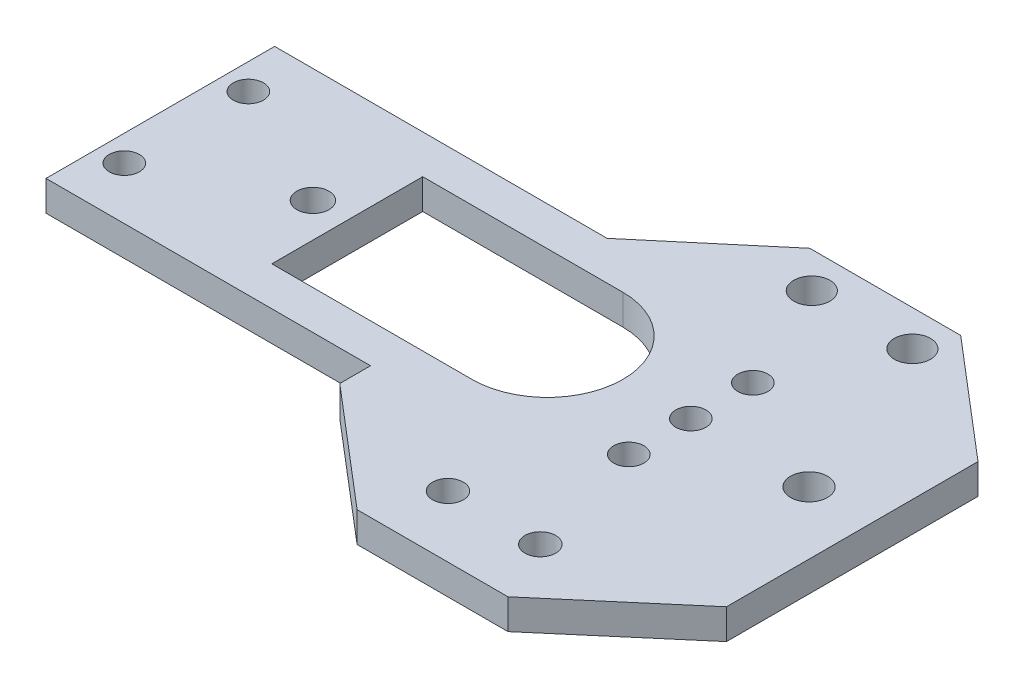
ISO-10303-21;
HEADER;
FILE_DESCRIPTION(('STEP AP214'),'2;1');
FILE_NAME('part.step','',(''),(''),'','','');
FILE_SCHEMA(('AUTOMOTIVE_DESIGN { 1 0 10303 214 1 1 1 1 }'));
ENDSEC;
DATA;
#1=APPLICATION_CONTEXT('core data for automotive mechanical design processes');
#2=APPLICATION_PROTOCOL_DEFINITION('international standard','automotive_design',2000,#1);
#3=PRODUCT_CONTEXT('',#1,'mechanical');
#4=PRODUCT('Part','Part','',(#3));
#5=PRODUCT_RELATED_PRODUCT_CATEGORY('part','',(#4));
#6=PRODUCT_DEFINITION_FORMATION('','',#4);
#7=PRODUCT_DEFINITION_CONTEXT('part definition',#1,'design');
#8=PRODUCT_DEFINITION('design','',#6,#7);
#9=PRODUCT_DEFINITION_SHAPE('','',#8);
#10=(LENGTH_UNIT() NAMED_UNIT(*) SI_UNIT(.MILLI.,.METRE.));
#11=(NAMED_UNIT(*) PLANE_ANGLE_UNIT() SI_UNIT($,.RADIAN.));
#12=(NAMED_UNIT(*) SI_UNIT($,.STERADIAN.) SOLID_ANGLE_UNIT());
#13=UNCERTAINTY_MEASURE_WITH_UNIT(LENGTH_MEASURE(1.E-05),#10,'distance_accuracy_value','');
#14=(GEOMETRIC_REPRESENTATION_CONTEXT(3) GLOBAL_UNCERTAINTY_ASSIGNED_CONTEXT((#13)) GLOBAL_UNIT_ASSIGNED_CONTEXT((#10,
#11,#12)) REPRESENTATION_CONTEXT('',''));
#15=CARTESIAN_POINT('',(0.,0.,0.));
#16=DIRECTION('',(0.,0.,1.));
#17=DIRECTION('',(1.,0.,0.));
#18=AXIS2_PLACEMENT_3D('',#15,#16,#17);
#19=CARTESIAN_POINT('',(0.,3.,0.));
#20=DIRECTION('',(0.,1.,0.));
#21=DIRECTION('',(0.,0.,1.));
#22=AXIS2_PLACEMENT_3D('',#19,#20,#21);
#23=PLANE('',#22);
#24=CARTESIAN_POINT('',(-1.03922495505572,3.,-20.8623911356369));
#25=DIRECTION('',(0.,1.,0.));
#26=DIRECTION('',(0.,0.,1.));
#27=AXIS2_PLACEMENT_3D('',#24,#25,#26);
#28=CIRCLE('',#27,1.8);
#29=CARTESIAN_POINT('',(-1.03922495505572,3.,-19.0623911356369));
#30=VERTEX_POINT('',#29);
#31=EDGE_CURVE('E268',#30,#30,#28,.T.);
#32=ORIENTED_EDGE('',*,*,#31,.F.);
#33=EDGE_LOOP('',(#32));
#34=FACE_BOUND('',#33,.T.);
#35=CARTESIAN_POINT('',(-11.0392249550557,3.,-20.8623911356369));
#36=DIRECTION('',(0.,1.,0.));
#37=DIRECTION('',(0.,0.,1.));
#38=AXIS2_PLACEMENT_3D('',#35,#36,#37);
#39=CIRCLE('',#38,1.8);
#40=CARTESIAN_POINT('',(-11.0392249550557,3.,-19.0623911356369));
#41=VERTEX_POINT('',#40);
#42=EDGE_CURVE('E257',#41,#41,#39,.T.);
#43=ORIENTED_EDGE('',*,*,#42,.F.);
#44=EDGE_LOOP('',(#43));
#45=FACE_BOUND('',#44,.T.);
#46=CARTESIAN_POINT('',(-56.1948883954649,3.,-10.0085840249346));
#47=DIRECTION('',(0.,1.,0.));
#48=DIRECTION('',(0.,0.,1.));
#49=AXIS2_PLACEMENT_3D('',#46,#47,#48);
#50=CIRCLE('',#49,1.5);
#51=CARTESIAN_POINT('',(-56.1948883954649,3.,-8.50858402493456));
#52=VERTEX_POINT('',#51);
#53=EDGE_CURVE('E274',#52,#52,#50,.T.);
#54=ORIENTED_EDGE('',*,*,#53,.F.);
#55=EDGE_LOOP('',(#54));
#56=FACE_BOUND('',#55,.T.);
#57=CARTESIAN_POINT('',(-6.04488839546491,3.,-10.0085840249346));
#58=DIRECTION('',(0.,1.,0.));
#59=DIRECTION('',(0.,0.,1.));
#60=AXIS2_PLACEMENT_3D('',#57,#58,#59);
#61=CIRCLE('',#60,1.5);
#62=CARTESIAN_POINT('',(-6.04488839546491,3.,-8.50858402493456));
#63=VERTEX_POINT('',#62);
#64=EDGE_CURVE('E286',#63,#63,#61,.T.);
#65=ORIENTED_EDGE('',*,*,#64,.F.);
#66=EDGE_LOOP('',(#65));
#67=FACE_BOUND('',#66,.T.);
#68=CARTESIAN_POINT('',(-43.6105441866026,3.,-3.8423623744822));
#69=DIRECTION('',(0.,1.,0.));
#70=DIRECTION('',(0.,0.,1.));
#71=AXIS2_PLACEMENT_3D('',#68,#69,#70);
#72=CIRCLE('',#71,1.59727524343108);
#73=CARTESIAN_POINT('',(-43.6105441866026,3.,-2.24508713105113));
#74=VERTEX_POINT('',#73);
#75=EDGE_CURVE('E298',#74,#74,#72,.T.);
#76=ORIENTED_EDGE('',*,*,#75,.F.);
#77=EDGE_LOOP('',(#76));
#78=FACE_BOUND('',#77,.T.);
#79=CARTESIAN_POINT('',(-2.70488839546491,3.,14.4576376255178));
#80=DIRECTION('',(0.,1.,0.));
#81=DIRECTION('',(0.,0.,1.));
#82=AXIS2_PLACEMENT_3D('',#79,#80,#81);
#83=CIRCLE('',#82,1.53);
#84=CARTESIAN_POINT('',(-2.70488839546491,3.,15.9876376255178));
#85=VERTEX_POINT('',#84);
#86=EDGE_CURVE('E310',#85,#85,#83,.T.);
#87=ORIENTED_EDGE('',*,*,#86,.F.);
#88=EDGE_LOOP('',(#87));
#89=FACE_BOUND('',#88,.T.);
#90=DIRECTION('',(1.,0.,0.));
#91=VECTOR('',#90,1.);
#92=CARTESIAN_POINT('',(-40.1955543852779,3.,3.65763762551779));
#93=LINE('',#92,#91);
#94=CARTESIAN_POINT('',(-40.1955543852779,3.,3.65763762551779));
#95=VERTEX_POINT('',#94);
#96=CARTESIAN_POINT('',(-20.2948883954649,3.,3.65763762551779));
#97=VERTEX_POINT('',#96);
#98=EDGE_CURVE('E150',#95,#97,#93,.T.);
#99=ORIENTED_EDGE('',*,*,#98,.F.);
#100=DIRECTION('',(0.,0.,1.));
#101=VECTOR('',#100,1.);
#102=CARTESIAN_POINT('',(-40.1955543852779,3.,-11.3423623744822));
#103=LINE('',#102,#101);
#104=CARTESIAN_POINT('',(-40.1955543852779,3.,-11.3423623744822));
#105=VERTEX_POINT('',#104);
#106=EDGE_CURVE('E142',#105,#95,#103,.T.);
#107=ORIENTED_EDGE('',*,*,#106,.F.);
#108=DIRECTION('',(-1.,0.,0.));
#109=VECTOR('',#108,1.);
#110=CARTESIAN_POINT('',(-40.1955543852779,3.,-11.3423623744822));
#111=LINE('',#110,#109);
#112=CARTESIAN_POINT('',(-20.2948883954649,3.,-11.3423623744822));
#113=VERTEX_POINT('',#112);
#114=EDGE_CURVE('E165',#113,#105,#111,.T.);
#115=ORIENTED_EDGE('',*,*,#114,.F.);
#116=CARTESIAN_POINT('',(-20.2948883954649,3.,-3.84236237448221));
#117=DIRECTION('',(0.,1.,0.));
#118=DIRECTION('',(0.,0.,1.));
#119=AXIS2_PLACEMENT_3D('',#116,#117,#118);
#120=CIRCLE('',#119,7.5);
#121=EDGE_CURVE('E163',#97,#113,#120,.T.);
#122=ORIENTED_EDGE('',*,*,#121,.F.);
#123=EDGE_LOOP('',(#99,#107,#115,#122));
#124=FACE_BOUND('',#123,.T.);
#125=DIRECTION('',(1.,0.,0.));
#126=VECTOR('',#125,1.);
#127=CARTESIAN_POINT('',(-58.7725027595596,3.,7.52718204495617));
#128=LINE('',#127,#126);
#129=CARTESIAN_POINT('',(-58.7725027595596,3.,7.52718204495617));
#130=VERTEX_POINT('',#129);
#131=CARTESIAN_POINT('',(-26.5148883954649,3.,7.52718204495617));
#132=VERTEX_POINT('',#131);
#133=EDGE_CURVE('E181',#130,#132,#128,.T.);
#134=ORIENTED_EDGE('',*,*,#133,.T.);
#135=DIRECTION('',(0.,0.,1.));
#136=VECTOR('',#135,1.);
#137=CARTESIAN_POINT('',(-26.5148883954649,3.,10.5826376255178));
#138=LINE('',#137,#136);
#139=CARTESIAN_POINT('',(-26.5148883954649,3.,10.5826376255178));
#140=VERTEX_POINT('',#139);
#141=EDGE_CURVE('E183',#132,#140,#138,.T.);
#142=ORIENTED_EDGE('',*,*,#141,.T.);
#143=DIRECTION('',(0.76072083095599,0.,0.649079207300332));
#144=VECTOR('',#143,1.);
#145=CARTESIAN_POINT('',(-26.5148883954649,3.,10.5826376255178));
#146=LINE('',#145,#144);
#147=CARTESIAN_POINT('',(-14.7948883954649,3.,20.5826376255178));
#148=VERTEX_POINT('',#147);
#149=EDGE_CURVE('E186',#140,#148,#146,.T.);
#150=ORIENTED_EDGE('',*,*,#149,.T.);
#151=DIRECTION('',(1.,0.,0.));
#152=VECTOR('',#151,1.);
#153=CARTESIAN_POINT('',(-14.7948883954649,3.,20.5826376255178));
#154=LINE('',#153,#152);
#155=CARTESIAN_POINT('',(0.205111604535091,3.,20.5826376255178));
#156=VERTEX_POINT('',#155);
#157=EDGE_CURVE('E188',#148,#156,#154,.T.);
#158=ORIENTED_EDGE('',*,*,#157,.T.);
#159=DIRECTION('',(0.76072083095599,0.,-0.649079207300332));
#160=VECTOR('',#159,1.);
#161=CARTESIAN_POINT('',(11.9251116045351,3.,10.5826376255178));
#162=LINE('',#161,#160);
#163=CARTESIAN_POINT('',(11.9251116045351,3.,10.5826376255178));
#164=VERTEX_POINT('',#163);
#165=EDGE_CURVE('E190',#156,#164,#162,.T.);
#166=ORIENTED_EDGE('',*,*,#165,.T.);
#167=DIRECTION('',(0.,0.,-1.));
#168=VECTOR('',#167,1.);
#169=CARTESIAN_POINT('',(11.9251116045351,3.,-14.4173623744822));
#170=LINE('',#169,#168);
#171=CARTESIAN_POINT('',(11.9251116045351,3.,-14.4173623744822));
#172=VERTEX_POINT('',#171);
#173=EDGE_CURVE('E192',#164,#172,#170,.T.);
#174=ORIENTED_EDGE('',*,*,#173,.T.);
#175=DIRECTION('',(-0.76072083095599,0.,-0.649079207300332));
#176=VECTOR('',#175,1.);
#177=CARTESIAN_POINT('',(0.205111604535091,3.,-24.4173623744822));
#178=LINE('',#177,#176);
#179=CARTESIAN_POINT('',(0.205111604535091,3.,-24.4173623744822));
#180=VERTEX_POINT('',#179);
#181=EDGE_CURVE('E194',#172,#180,#178,.T.);
#182=ORIENTED_EDGE('',*,*,#181,.T.);
#183=DIRECTION('',(-1.,0.,0.));
#184=VECTOR('',#183,1.);
#185=CARTESIAN_POINT('',(-14.7948883954649,3.,-24.4173623744822));
#186=LINE('',#185,#184);
#187=CARTESIAN_POINT('',(-14.7948883954649,3.,-24.4173623744822));
#188=VERTEX_POINT('',#187);
#189=EDGE_CURVE('E196',#180,#188,#186,.T.);
#190=ORIENTED_EDGE('',*,*,#189,.T.);
#191=DIRECTION('',(-0.764461851807647,0.,0.644668967091501));
#192=VECTOR('',#191,1.);
#193=CARTESIAN_POINT('',(-25.7249537663058,3.,-15.200062732648));
#194=LINE('',#193,#192);
#195=CARTESIAN_POINT('',(-25.7249537663058,3.,-15.200062732648));
#196=VERTEX_POINT('',#195);
#197=EDGE_CURVE('E198',#188,#196,#194,.T.);
#198=ORIENTED_EDGE('',*,*,#197,.T.);
#199=DIRECTION('',(-1.,0.,0.));
#200=VECTOR('',#199,1.);
#201=CARTESIAN_POINT('',(-41.4058082658187,3.,-15.200062732648));
#202=LINE('',#201,#200);
#203=CARTESIAN_POINT('',(-58.7725027595596,3.,-15.200062732648));
#204=VERTEX_POINT('',#203);
#205=EDGE_CURVE('E200',#196,#204,#202,.T.);
#206=ORIENTED_EDGE('',*,*,#205,.T.);
#207=DIRECTION('',(0.,0.,1.));
#208=VECTOR('',#207,1.);
#209=CARTESIAN_POINT('',(-58.7725027595596,3.,-15.200062732648));
#210=LINE('',#209,#208);
#211=EDGE_CURVE('E202',#204,#130,#210,.T.);
#212=ORIENTED_EDGE('',*,*,#211,.T.);
#213=EDGE_LOOP('',(#134,#142,#150,#158,#166,#174,#182,#190,#198,#206,#212));
#214=FACE_BOUND('',#213,.T.);
#215=CARTESIAN_POINT('',(-11.8848883954649,3.,14.4576376255178));
#216=DIRECTION('',(0.,1.,0.));
#217=DIRECTION('',(0.,0.,1.));
#218=AXIS2_PLACEMENT_3D('',#215,#216,#217);
#219=CIRCLE('',#218,1.53);
#220=CARTESIAN_POINT('',(-11.8848883954649,3.,15.9876376255178));
#221=VERTEX_POINT('',#220);
#222=EDGE_CURVE('E171',#221,#221,#219,.T.);
#223=ORIENTED_EDGE('',*,*,#222,.F.);
#224=EDGE_LOOP('',(#223));
#225=FACE_BOUND('',#224,.T.);
#226=CARTESIAN_POINT('',(5.70511160453509,3.,-3.84236237448221));
#227=DIRECTION('',(0.,1.,0.));
#228=DIRECTION('',(0.,0.,1.));
#229=AXIS2_PLACEMENT_3D('',#226,#227,#228);
#230=CIRCLE('',#229,1.83791952576356);
#231=CARTESIAN_POINT('',(5.70511160453509,3.,-2.00444284871865));
#232=VERTEX_POINT('',#231);
#233=EDGE_CURVE('E304',#232,#232,#230,.T.);
#234=ORIENTED_EDGE('',*,*,#233,.F.);
#235=EDGE_LOOP('',(#234));
#236=FACE_BOUND('',#235,.T.);
#237=CARTESIAN_POINT('',(-6.04488839546491,3.,-3.84236237448221));
#238=DIRECTION('',(0.,1.,0.));
#239=DIRECTION('',(0.,0.,1.));
#240=AXIS2_PLACEMENT_3D('',#237,#238,#239);
#241=CIRCLE('',#240,1.5);
#242=CARTESIAN_POINT('',(-6.04488839546491,3.,-2.34236237448221));
#243=VERTEX_POINT('',#242);
#244=EDGE_CURVE('E292',#243,#243,#241,.T.);
#245=ORIENTED_EDGE('',*,*,#244,.F.);
#246=EDGE_LOOP('',(#245));
#247=FACE_BOUND('',#246,.T.);
#248=CARTESIAN_POINT('',(-6.04488839546491,3.,2.32385927597014));
#249=DIRECTION('',(0.,1.,0.));
#250=DIRECTION('',(0.,0.,1.));
#251=AXIS2_PLACEMENT_3D('',#248,#249,#250);
#252=CIRCLE('',#251,1.5);
#253=CARTESIAN_POINT('',(-6.04488839546491,3.,3.82385927597014));
#254=VERTEX_POINT('',#253);
#255=EDGE_CURVE('E280',#254,#254,#252,.T.);
#256=ORIENTED_EDGE('',*,*,#255,.F.);
#257=EDGE_LOOP('',(#256));
#258=FACE_BOUND('',#257,.T.);
#259=CARTESIAN_POINT('',(-56.1948883954649,3.,2.32385927597015));
#260=DIRECTION('',(0.,1.,0.));
#261=DIRECTION('',(0.,0.,1.));
#262=AXIS2_PLACEMENT_3D('',#259,#260,#261);
#263=CIRCLE('',#262,1.5);
#264=CARTESIAN_POINT('',(-56.1948883954649,3.,3.82385927597015));
#265=VERTEX_POINT('',#264);
#266=EDGE_CURVE('E261',#265,#265,#263,.T.);
#267=ORIENTED_EDGE('',*,*,#266,.F.);
#268=EDGE_LOOP('',(#267));
#269=FACE_BOUND('',#268,.T.);
#270=ADVANCED_FACE('F33',(#34,#45,#56,#67,#78,#89,#124,#214,#225,#236,#247,#258,#269),#23,.T.);
#271=CARTESIAN_POINT('',(0.,0.,0.));
#272=DIRECTION('',(0.,1.,0.));
#273=DIRECTION('',(0.,0.,1.));
#274=AXIS2_PLACEMENT_3D('',#271,#272,#273);
#275=PLANE('',#274);
#276=CARTESIAN_POINT('',(-1.03922495505572,0.,-20.8623911356369));
#277=DIRECTION('',(0.,1.,0.));
#278=DIRECTION('',(0.,0.,1.));
#279=AXIS2_PLACEMENT_3D('',#276,#277,#278);
#280=CIRCLE('',#279,1.8);
#281=CARTESIAN_POINT('',(-1.03922495505572,0.,-19.0623911356369));
#282=VERTEX_POINT('',#281);
#283=EDGE_CURVE('E37',#282,#282,#280,.T.);
#284=ORIENTED_EDGE('',*,*,#283,.T.);
#285=EDGE_LOOP('',(#284));
#286=FACE_BOUND('',#285,.T.);
#287=CARTESIAN_POINT('',(-11.0392249550557,0.,-20.8623911356369));
#288=DIRECTION('',(0.,1.,0.));
#289=DIRECTION('',(0.,0.,1.));
#290=AXIS2_PLACEMENT_3D('',#287,#288,#289);
#291=CIRCLE('',#290,1.8);
#292=CARTESIAN_POINT('',(-11.0392249550557,0.,-19.0623911356369));
#293=VERTEX_POINT('',#292);
#294=EDGE_CURVE('E254',#293,#293,#291,.T.);
#295=ORIENTED_EDGE('',*,*,#294,.T.);
#296=EDGE_LOOP('',(#295));
#297=FACE_BOUND('',#296,.T.);
#298=CARTESIAN_POINT('',(-56.1948883954649,0.,-10.0085840249346));
#299=DIRECTION('',(0.,1.,0.));
#300=DIRECTION('',(0.,0.,1.));
#301=AXIS2_PLACEMENT_3D('',#298,#299,#300);
#302=CIRCLE('',#301,1.5);
#303=CARTESIAN_POINT('',(-56.1948883954649,0.,-8.50858402493456));
#304=VERTEX_POINT('',#303);
#305=EDGE_CURVE('E272',#304,#304,#302,.T.);
#306=ORIENTED_EDGE('',*,*,#305,.T.);
#307=EDGE_LOOP('',(#306));
#308=FACE_BOUND('',#307,.T.);
#309=CARTESIAN_POINT('',(-6.04488839546491,0.,-10.0085840249346));
#310=DIRECTION('',(0.,1.,0.));
#311=DIRECTION('',(0.,0.,1.));
#312=AXIS2_PLACEMENT_3D('',#309,#310,#311);
#313=CIRCLE('',#312,1.5);
#314=CARTESIAN_POINT('',(-6.04488839546491,0.,-8.50858402493456));
#315=VERTEX_POINT('',#314);
#316=EDGE_CURVE('E283',#315,#315,#313,.T.);
#317=ORIENTED_EDGE('',*,*,#316,.T.);
#318=EDGE_LOOP('',(#317));
#319=FACE_BOUND('',#318,.T.);
#320=CARTESIAN_POINT('',(-43.6105441866026,0.,-3.8423623744822));
#321=DIRECTION('',(0.,1.,0.));
#322=DIRECTION('',(0.,0.,1.));
#323=AXIS2_PLACEMENT_3D('',#320,#321,#322);
#324=CIRCLE('',#323,1.59727524343108);
#325=CARTESIAN_POINT('',(-43.6105441866026,0.,-2.24508713105113));
#326=VERTEX_POINT('',#325);
#327=EDGE_CURVE('E295',#326,#326,#324,.T.);
#328=ORIENTED_EDGE('',*,*,#327,.T.);
#329=EDGE_LOOP('',(#328));
#330=FACE_BOUND('',#329,.T.);
#331=CARTESIAN_POINT('',(-2.70488839546491,0.,14.4576376255178));
#332=DIRECTION('',(0.,1.,0.));
#333=DIRECTION('',(0.,0.,1.));
#334=AXIS2_PLACEMENT_3D('',#331,#332,#333);
#335=CIRCLE('',#334,1.53);
#336=CARTESIAN_POINT('',(-2.70488839546491,0.,15.9876376255178));
#337=VERTEX_POINT('',#336);
#338=EDGE_CURVE('E307',#337,#337,#335,.T.);
#339=ORIENTED_EDGE('',*,*,#338,.T.);
#340=EDGE_LOOP('',(#339));
#341=FACE_BOUND('',#340,.T.);
#342=DIRECTION('',(0.,0.,1.));
#343=VECTOR('',#342,1.);
#344=CARTESIAN_POINT('',(-40.1955543852779,0.,-11.3423623744822));
#345=LINE('',#344,#343);
#346=CARTESIAN_POINT('',(-40.1955543852779,0.,-11.3423623744822));
#347=VERTEX_POINT('',#346);
#348=CARTESIAN_POINT('',(-40.1955543852779,0.,3.65763762551779));
#349=VERTEX_POINT('',#348);
#350=EDGE_CURVE('E58',#347,#349,#345,.T.);
#351=ORIENTED_EDGE('',*,*,#350,.T.);
#352=DIRECTION('',(1.,0.,0.));
#353=VECTOR('',#352,1.);
#354=CARTESIAN_POINT('',(-40.1955543852779,0.,3.65763762551779));
#355=LINE('',#354,#353);
#356=CARTESIAN_POINT('',(-20.2948883954649,0.,3.65763762551779));
#357=VERTEX_POINT('',#356);
#358=EDGE_CURVE('E157',#349,#357,#355,.T.);
#359=ORIENTED_EDGE('',*,*,#358,.T.);
#360=CARTESIAN_POINT('',(-20.2948883954649,0.,-3.84236237448221));
#361=DIRECTION('',(0.,1.,0.));
#362=DIRECTION('',(0.,0.,1.));
#363=AXIS2_PLACEMENT_3D('',#360,#361,#362);
#364=CIRCLE('',#363,7.5);
#365=CARTESIAN_POINT('',(-20.2948883954649,0.,-11.3423623744822));
#366=VERTEX_POINT('',#365);
#367=EDGE_CURVE('E173',#357,#366,#364,.T.);
#368=ORIENTED_EDGE('',*,*,#367,.T.);
#369=DIRECTION('',(-1.,0.,0.));
#370=VECTOR('',#369,1.);
#371=CARTESIAN_POINT('',(-40.1955543852779,0.,-11.3423623744822));
#372=LINE('',#371,#370);
#373=EDGE_CURVE('E151',#366,#347,#372,.T.);
#374=ORIENTED_EDGE('',*,*,#373,.T.);
#375=EDGE_LOOP('',(#351,#359,#368,#374));
#376=FACE_BOUND('',#375,.T.);
#377=DIRECTION('',(1.,0.,0.));
#378=VECTOR('',#377,1.);
#379=CARTESIAN_POINT('',(-26.5148883954649,0.,7.52718204495617));
#380=LINE('',#379,#378);
#381=CARTESIAN_POINT('',(-58.7725027595596,0.,7.52718204495617));
#382=VERTEX_POINT('',#381);
#383=CARTESIAN_POINT('',(-26.5148883954649,0.,7.52718204495617));
#384=VERTEX_POINT('',#383);
#385=EDGE_CURVE('E158',#382,#384,#380,.T.);
#386=ORIENTED_EDGE('',*,*,#385,.F.);
#387=DIRECTION('',(0.,0.,1.));
#388=VECTOR('',#387,1.);
#389=CARTESIAN_POINT('',(-58.7725027595596,0.,-15.200062732648));
#390=LINE('',#389,#388);
#391=CARTESIAN_POINT('',(-58.7725027595596,0.,-15.200062732648));
#392=VERTEX_POINT('',#391);
#393=EDGE_CURVE('E184',#392,#382,#390,.T.);
#394=ORIENTED_EDGE('',*,*,#393,.F.);
#395=DIRECTION('',(-1.,0.,0.));
#396=VECTOR('',#395,1.);
#397=CARTESIAN_POINT('',(-41.4058082658187,0.,-15.200062732648));
#398=LINE('',#397,#396);
#399=CARTESIAN_POINT('',(-25.7249537663058,0.,-15.200062732648));
#400=VERTEX_POINT('',#399);
#401=EDGE_CURVE('E223',#400,#392,#398,.T.);
#402=ORIENTED_EDGE('',*,*,#401,.F.);
#403=DIRECTION('',(-0.764461851807647,0.,0.644668967091501));
#404=VECTOR('',#403,1.);
#405=CARTESIAN_POINT('',(-25.7249537663058,0.,-15.200062732648));
#406=LINE('',#405,#404);
#407=CARTESIAN_POINT('',(-14.7948883954649,0.,-24.4173623744822));
#408=VERTEX_POINT('',#407);
#409=EDGE_CURVE('E220',#408,#400,#406,.T.);
#410=ORIENTED_EDGE('',*,*,#409,.F.);
#411=DIRECTION('',(-1.,0.,0.));
#412=VECTOR('',#411,1.);
#413=CARTESIAN_POINT('',(-14.7948883954649,0.,-24.4173623744822));
#414=LINE('',#413,#412);
#415=CARTESIAN_POINT('',(0.205111604535091,0.,-24.4173623744822));
#416=VERTEX_POINT('',#415);
#417=EDGE_CURVE('E218',#416,#408,#414,.T.);
#418=ORIENTED_EDGE('',*,*,#417,.F.);
#419=DIRECTION('',(-0.76072083095599,0.,-0.649079207300332));
#420=VECTOR('',#419,1.);
#421=CARTESIAN_POINT('',(0.205111604535091,0.,-24.4173623744822));
#422=LINE('',#421,#420);
#423=CARTESIAN_POINT('',(11.9251116045351,0.,-14.4173623744822));
#424=VERTEX_POINT('',#423);
#425=EDGE_CURVE('E216',#424,#416,#422,.T.);
#426=ORIENTED_EDGE('',*,*,#425,.F.);
#427=DIRECTION('',(0.,0.,-1.));
#428=VECTOR('',#427,1.);
#429=CARTESIAN_POINT('',(11.9251116045351,0.,-14.4173623744822));
#430=LINE('',#429,#428);
#431=CARTESIAN_POINT('',(11.9251116045351,0.,10.5826376255178));
#432=VERTEX_POINT('',#431);
#433=EDGE_CURVE('E214',#432,#424,#430,.T.);
#434=ORIENTED_EDGE('',*,*,#433,.F.);
#435=DIRECTION('',(0.76072083095599,0.,-0.649079207300332));
#436=VECTOR('',#435,1.);
#437=CARTESIAN_POINT('',(11.9251116045351,0.,10.5826376255178));
#438=LINE('',#437,#436);
#439=CARTESIAN_POINT('',(0.205111604535091,0.,20.5826376255178));
#440=VERTEX_POINT('',#439);
#441=EDGE_CURVE('E212',#440,#432,#438,.T.);
#442=ORIENTED_EDGE('',*,*,#441,.F.);
#443=DIRECTION('',(1.,0.,0.));
#444=VECTOR('',#443,1.);
#445=CARTESIAN_POINT('',(-14.7948883954649,0.,20.5826376255178));
#446=LINE('',#445,#444);
#447=CARTESIAN_POINT('',(-14.7948883954649,0.,20.5826376255178));
#448=VERTEX_POINT('',#447);
#449=EDGE_CURVE('E210',#448,#440,#446,.T.);
#450=ORIENTED_EDGE('',*,*,#449,.F.);
#451=DIRECTION('',(0.76072083095599,0.,0.649079207300332));
#452=VECTOR('',#451,1.);
#453=CARTESIAN_POINT('',(-26.5148883954649,0.,10.5826376255178));
#454=LINE('',#453,#452);
#455=CARTESIAN_POINT('',(-26.5148883954649,0.,10.5826376255178));
#456=VERTEX_POINT('',#455);
#457=EDGE_CURVE('E208',#456,#448,#454,.T.);
#458=ORIENTED_EDGE('',*,*,#457,.F.);
#459=DIRECTION('',(0.,0.,1.));
#460=VECTOR('',#459,1.);
#461=CARTESIAN_POINT('',(-26.5148883954649,0.,10.5826376255178));
#462=LINE('',#461,#460);
#463=EDGE_CURVE('E206',#384,#456,#462,.T.);
#464=ORIENTED_EDGE('',*,*,#463,.F.);
#465=EDGE_LOOP('',(#386,#394,#402,#410,#418,#426,#434,#442,#450,#458,#464));
#466=FACE_BOUND('',#465,.T.);
#467=CARTESIAN_POINT('',(-11.8848883954649,0.,14.4576376255178));
#468=DIRECTION('',(0.,1.,0.));
#469=DIRECTION('',(0.,0.,1.));
#470=AXIS2_PLACEMENT_3D('',#467,#468,#469);
#471=CIRCLE('',#470,1.53);
#472=CARTESIAN_POINT('',(-11.8848883954649,0.,15.9876376255178));
#473=VERTEX_POINT('',#472);
#474=EDGE_CURVE('E313',#473,#473,#471,.T.);
#475=ORIENTED_EDGE('',*,*,#474,.T.);
#476=EDGE_LOOP('',(#475));
#477=FACE_BOUND('',#476,.T.);
#478=CARTESIAN_POINT('',(5.70511160453509,0.,-3.84236237448221));
#479=DIRECTION('',(0.,1.,0.));
#480=DIRECTION('',(0.,0.,1.));
#481=AXIS2_PLACEMENT_3D('',#478,#479,#480);
#482=CIRCLE('',#481,1.83791952576356);
#483=CARTESIAN_POINT('',(5.70511160453509,0.,-2.00444284871865));
#484=VERTEX_POINT('',#483);
#485=EDGE_CURVE('E301',#484,#484,#482,.T.);
#486=ORIENTED_EDGE('',*,*,#485,.T.);
#487=EDGE_LOOP('',(#486));
#488=FACE_BOUND('',#487,.T.);
#489=CARTESIAN_POINT('',(-6.04488839546491,0.,-3.84236237448221));
#490=DIRECTION('',(0.,1.,0.));
#491=DIRECTION('',(0.,0.,1.));
#492=AXIS2_PLACEMENT_3D('',#489,#490,#491);
#493=CIRCLE('',#492,1.5);
#494=CARTESIAN_POINT('',(-6.04488839546491,0.,-2.34236237448221));
#495=VERTEX_POINT('',#494);
#496=EDGE_CURVE('E289',#495,#495,#493,.T.);
#497=ORIENTED_EDGE('',*,*,#496,.T.);
#498=EDGE_LOOP('',(#497));
#499=FACE_BOUND('',#498,.T.);
#500=CARTESIAN_POINT('',(-6.04488839546491,0.,2.32385927597014));
#501=DIRECTION('',(0.,1.,0.));
#502=DIRECTION('',(0.,0.,1.));
#503=AXIS2_PLACEMENT_3D('',#500,#501,#502);
#504=CIRCLE('',#503,1.5);
#505=CARTESIAN_POINT('',(-6.04488839546491,0.,3.82385927597014));
#506=VERTEX_POINT('',#505);
#507=EDGE_CURVE('E277',#506,#506,#504,.T.);
#508=ORIENTED_EDGE('',*,*,#507,.T.);
#509=EDGE_LOOP('',(#508));
#510=FACE_BOUND('',#509,.T.);
#511=CARTESIAN_POINT('',(-56.1948883954649,0.,2.32385927597015));
#512=DIRECTION('',(0.,1.,0.));
#513=DIRECTION('',(0.,0.,1.));
#514=AXIS2_PLACEMENT_3D('',#511,#512,#513);
#515=CIRCLE('',#514,1.5);
#516=CARTESIAN_POINT('',(-56.1948883954649,0.,3.82385927597015));
#517=VERTEX_POINT('',#516);
#518=EDGE_CURVE('E256',#517,#517,#515,.T.);
#519=ORIENTED_EDGE('',*,*,#518,.T.);
#520=EDGE_LOOP('',(#519));
#521=FACE_BOUND('',#520,.T.);
#522=ADVANCED_FACE('F320',(#286,#297,#308,#319,#330,#341,#376,#466,#477,#488,#499,#510,#521),
#275,.F.);
#523=CARTESIAN_POINT('',(-26.5148883954649,3.,7.52718204495617));
#524=DIRECTION('',(0.,0.,-1.));
#525=DIRECTION('',(-1.,0.,0.));
#526=AXIS2_PLACEMENT_3D('',#523,#524,#525);
#527=PLANE('',#526);
#528=ORIENTED_EDGE('',*,*,#385,.T.);
#529=DIRECTION('',(0.,-1.,0.));
#530=VECTOR('',#529,1.);
#531=CARTESIAN_POINT('',(-26.5148883954649,3.,7.52718204495617));
#532=LINE('',#531,#530);
#533=EDGE_CURVE('E11',#132,#384,#532,.T.);
#534=ORIENTED_EDGE('',*,*,#533,.F.);
#535=ORIENTED_EDGE('',*,*,#133,.F.);
#536=DIRECTION('',(0.,-1.,0.));
#537=VECTOR('',#536,1.);
#538=CARTESIAN_POINT('',(-58.7725027595596,3.,7.52718204495617));
#539=LINE('',#538,#537);
#540=EDGE_CURVE('E204',#130,#382,#539,.T.);
#541=ORIENTED_EDGE('',*,*,#540,.T.);
#542=EDGE_LOOP('',(#528,#534,#535,#541));
#543=FACE_BOUND('',#542,.T.);
#544=ADVANCED_FACE('F35',(#543),#527,.F.);
#545=CARTESIAN_POINT('',(-26.5148883954649,3.,10.5826376255178));
#546=DIRECTION('',(1.,0.,0.));
#547=DIRECTION('',(0.,0.,-1.));
#548=AXIS2_PLACEMENT_3D('',#545,#546,#547);
#549=PLANE('',#548);
#550=ORIENTED_EDGE('',*,*,#463,.T.);
#551=DIRECTION('',(0.,-1.,0.));
#552=VECTOR('',#551,1.);
#553=CARTESIAN_POINT('',(-26.5148883954649,3.,10.5826376255178));
#554=LINE('',#553,#552);
#555=EDGE_CURVE('E42',#140,#456,#554,.T.);
#556=ORIENTED_EDGE('',*,*,#555,.F.);
#557=ORIENTED_EDGE('',*,*,#141,.F.);
#558=ORIENTED_EDGE('',*,*,#533,.T.);
#559=EDGE_LOOP('',(#550,#556,#557,#558));
#560=FACE_BOUND('',#559,.T.);
#561=ADVANCED_FACE('F385',(#560),#549,.F.);
#562=CARTESIAN_POINT('',(-26.5148883954649,3.,10.5826376255178));
#563=DIRECTION('',(0.649079207300332,0.,-0.76072083095599));
#564=DIRECTION('',(-0.76072083095599,0.,-0.649079207300332));
#565=AXIS2_PLACEMENT_3D('',#562,#563,#564);
#566=PLANE('',#565);
#567=ORIENTED_EDGE('',*,*,#457,.T.);
#568=DIRECTION('',(0.,-1.,0.));
#569=VECTOR('',#568,1.);
#570=CARTESIAN_POINT('',(-14.7948883954649,3.,20.5826376255178));
#571=LINE('',#570,#569);
#572=EDGE_CURVE('E250',#148,#448,#571,.T.);
#573=ORIENTED_EDGE('',*,*,#572,.F.);
#574=ORIENTED_EDGE('',*,*,#149,.F.);
#575=ORIENTED_EDGE('',*,*,#555,.T.);
#576=EDGE_LOOP('',(#567,#573,#574,#575));
#577=FACE_BOUND('',#576,.T.);
#578=ADVANCED_FACE('F382',(#577),#566,.F.);
#579=CARTESIAN_POINT('',(-14.7948883954649,3.,20.5826376255178));
#580=DIRECTION('',(0.,0.,-1.));
#581=DIRECTION('',(-1.,0.,0.));
#582=AXIS2_PLACEMENT_3D('',#579,#580,#581);
#583=PLANE('',#582);
#584=ORIENTED_EDGE('',*,*,#449,.T.);
#585=DIRECTION('',(0.,-1.,0.));
#586=VECTOR('',#585,1.);
#587=CARTESIAN_POINT('',(0.205111604535091,3.,20.5826376255178));
#588=LINE('',#587,#586);
#589=EDGE_CURVE('E247',#156,#440,#588,.T.);
#590=ORIENTED_EDGE('',*,*,#589,.F.);
#591=ORIENTED_EDGE('',*,*,#157,.F.);
#592=ORIENTED_EDGE('',*,*,#572,.T.);
#593=EDGE_LOOP('',(#584,#590,#591,#592));
#594=FACE_BOUND('',#593,.T.);
#595=ADVANCED_FACE('F378',(#594),#583,.F.);
#596=CARTESIAN_POINT('',(11.9251116045351,3.,10.5826376255178));
#597=DIRECTION('',(-0.649079207300332,0.,-0.76072083095599));
#598=DIRECTION('',(-0.76072083095599,0.,0.649079207300332));
#599=AXIS2_PLACEMENT_3D('',#596,#597,#598);
#600=PLANE('',#599);
#601=ORIENTED_EDGE('',*,*,#441,.T.);
#602=DIRECTION('',(0.,-1.,0.));
#603=VECTOR('',#602,1.);
#604=CARTESIAN_POINT('',(11.9251116045351,3.,10.5826376255178));
#605=LINE('',#604,#603);
#606=EDGE_CURVE('E244',#164,#432,#605,.T.);
#607=ORIENTED_EDGE('',*,*,#606,.F.);
#608=ORIENTED_EDGE('',*,*,#165,.F.);
#609=ORIENTED_EDGE('',*,*,#589,.T.);
#610=EDGE_LOOP('',(#601,#607,#608,#609));
#611=FACE_BOUND('',#610,.T.);
#612=ADVANCED_FACE('F374',(#611),#600,.F.);
#613=CARTESIAN_POINT('',(11.9251116045351,3.,-14.4173623744822));
#614=DIRECTION('',(-1.,0.,0.));
#615=DIRECTION('',(0.,0.,1.));
#616=AXIS2_PLACEMENT_3D('',#613,#614,#615);
#617=PLANE('',#616);
#618=ORIENTED_EDGE('',*,*,#433,.T.);
#619=DIRECTION('',(0.,-1.,0.));
#620=VECTOR('',#619,1.);
#621=CARTESIAN_POINT('',(11.9251116045351,3.,-14.4173623744822));
#622=LINE('',#621,#620);
#623=EDGE_CURVE('E241',#172,#424,#622,.T.);
#624=ORIENTED_EDGE('',*,*,#623,.F.);
#625=ORIENTED_EDGE('',*,*,#173,.F.);
#626=ORIENTED_EDGE('',*,*,#606,.T.);
#627=EDGE_LOOP('',(#618,#624,#625,#626));
#628=FACE_BOUND('',#627,.T.);
#629=ADVANCED_FACE('F370',(#628),#617,.F.);
#630=CARTESIAN_POINT('',(0.205111604535091,3.,-24.4173623744822));
#631=DIRECTION('',(-0.649079207300332,0.,0.76072083095599));
#632=DIRECTION('',(0.76072083095599,0.,0.649079207300332));
#633=AXIS2_PLACEMENT_3D('',#630,#631,#632);
#634=PLANE('',#633);
#635=ORIENTED_EDGE('',*,*,#425,.T.);
#636=DIRECTION('',(0.,-1.,0.));
#637=VECTOR('',#636,1.);
#638=CARTESIAN_POINT('',(0.205111604535091,3.,-24.4173623744822));
#639=LINE('',#638,#637);
#640=EDGE_CURVE('E238',#180,#416,#639,.T.);
#641=ORIENTED_EDGE('',*,*,#640,.F.);
#642=ORIENTED_EDGE('',*,*,#181,.F.);
#643=ORIENTED_EDGE('',*,*,#623,.T.);
#644=EDGE_LOOP('',(#635,#641,#642,#643));
#645=FACE_BOUND('',#644,.T.);
#646=ADVANCED_FACE('F366',(#645),#634,.F.);
#647=CARTESIAN_POINT('',(-14.7948883954649,3.,-24.4173623744822));
#648=DIRECTION('',(0.,0.,1.));
#649=DIRECTION('',(1.,0.,0.));
#650=AXIS2_PLACEMENT_3D('',#647,#648,#649);
#651=PLANE('',#650);
#652=ORIENTED_EDGE('',*,*,#417,.T.);
#653=DIRECTION('',(0.,-1.,0.));
#654=VECTOR('',#653,1.);
#655=CARTESIAN_POINT('',(-14.7948883954649,3.,-24.4173623744822));
#656=LINE('',#655,#654);
#657=EDGE_CURVE('E235',#188,#408,#656,.T.);
#658=ORIENTED_EDGE('',*,*,#657,.F.);
#659=ORIENTED_EDGE('',*,*,#189,.F.);
#660=ORIENTED_EDGE('',*,*,#640,.T.);
#661=EDGE_LOOP('',(#652,#658,#659,#660));
#662=FACE_BOUND('',#661,.T.);
#663=ADVANCED_FACE('F362',(#662),#651,.F.);
#664=CARTESIAN_POINT('',(-25.7249537663058,3.,-15.200062732648));
#665=DIRECTION('',(0.644668967091501,0.,0.764461851807647));
#666=DIRECTION('',(0.764461851807647,0.,-0.644668967091501));
#667=AXIS2_PLACEMENT_3D('',#664,#665,#666);
#668=PLANE('',#667);
#669=ORIENTED_EDGE('',*,*,#409,.T.);
#670=DIRECTION('',(0.,-1.,0.));
#671=VECTOR('',#670,1.);
#672=CARTESIAN_POINT('',(-25.7249537663058,3.,-15.200062732648));
#673=LINE('',#672,#671);
#674=EDGE_CURVE('E232',#196,#400,#673,.T.);
#675=ORIENTED_EDGE('',*,*,#674,.F.);
#676=ORIENTED_EDGE('',*,*,#197,.F.);
#677=ORIENTED_EDGE('',*,*,#657,.T.);
#678=EDGE_LOOP('',(#669,#675,#676,#677));
#679=FACE_BOUND('',#678,.T.);
#680=ADVANCED_FACE('F358',(#679),#668,.F.);
#681=CARTESIAN_POINT('',(-41.4058082658187,3.,-15.200062732648));
#682=DIRECTION('',(0.,0.,1.));
#683=DIRECTION('',(1.,0.,0.));
#684=AXIS2_PLACEMENT_3D('',#681,#682,#683);
#685=PLANE('',#684);
#686=ORIENTED_EDGE('',*,*,#401,.T.);
#687=DIRECTION('',(0.,-1.,0.));
#688=VECTOR('',#687,1.);
#689=CARTESIAN_POINT('',(-58.7725027595596,3.,-15.200062732648));
#690=LINE('',#689,#688);
#691=EDGE_CURVE('E229',#204,#392,#690,.T.);
#692=ORIENTED_EDGE('',*,*,#691,.F.);
#693=ORIENTED_EDGE('',*,*,#205,.F.);
#694=ORIENTED_EDGE('',*,*,#674,.T.);
#695=EDGE_LOOP('',(#686,#692,#693,#694));
#696=FACE_BOUND('',#695,.T.);
#697=ADVANCED_FACE('F354',(#696),#685,.F.);
#698=CARTESIAN_POINT('',(-58.7725027595596,3.,-15.200062732648));
#699=DIRECTION('',(1.,0.,0.));
#700=DIRECTION('',(0.,0.,-1.));
#701=AXIS2_PLACEMENT_3D('',#698,#699,#700);
#702=PLANE('',#701);
#703=ORIENTED_EDGE('',*,*,#393,.T.);
#704=ORIENTED_EDGE('',*,*,#540,.F.);
#705=ORIENTED_EDGE('',*,*,#211,.F.);
#706=ORIENTED_EDGE('',*,*,#691,.T.);
#707=EDGE_LOOP('',(#703,#704,#705,#706));
#708=FACE_BOUND('',#707,.T.);
#709=ADVANCED_FACE('F351',(#708),#702,.F.);
#710=CARTESIAN_POINT('',(-40.1955543852779,3.,-11.3423623744822));
#711=DIRECTION('',(1.,0.,0.));
#712=DIRECTION('',(0.,0.,-1.));
#713=AXIS2_PLACEMENT_3D('',#710,#711,#712);
#714=PLANE('',#713);
#715=ORIENTED_EDGE('',*,*,#350,.F.);
#716=DIRECTION('',(0.,-1.,0.));
#717=VECTOR('',#716,1.);
#718=CARTESIAN_POINT('',(-40.1955543852779,3.,-11.3423623744822));
#719=LINE('',#718,#717);
#720=EDGE_CURVE('E146',#105,#347,#719,.T.);
#721=ORIENTED_EDGE('',*,*,#720,.F.);
#722=ORIENTED_EDGE('',*,*,#106,.T.);
#723=DIRECTION('',(0.,-1.,0.));
#724=VECTOR('',#723,1.);
#725=CARTESIAN_POINT('',(-40.1955543852779,3.,3.65763762551779));
#726=LINE('',#725,#724);
#727=EDGE_CURVE('E145',#95,#349,#726,.T.);
#728=ORIENTED_EDGE('',*,*,#727,.T.);
#729=EDGE_LOOP('',(#715,#721,#722,#728));
#730=FACE_BOUND('',#729,.T.);
#731=ADVANCED_FACE('F144',(#730),#714,.T.);
#732=CARTESIAN_POINT('',(-40.1955543852779,3.,3.65763762551779));
#733=DIRECTION('',(0.,0.,-1.));
#734=DIRECTION('',(-1.,0.,0.));
#735=AXIS2_PLACEMENT_3D('',#732,#733,#734);
#736=PLANE('',#735);
#737=ORIENTED_EDGE('',*,*,#358,.F.);
#738=ORIENTED_EDGE('',*,*,#727,.F.);
#739=ORIENTED_EDGE('',*,*,#98,.T.);
#740=DIRECTION('',(0.,-1.,0.));
#741=VECTOR('',#740,1.);
#742=CARTESIAN_POINT('',(-20.2948883954649,3.,3.65763762551779));
#743=LINE('',#742,#741);
#744=EDGE_CURVE('E159',#97,#357,#743,.T.);
#745=ORIENTED_EDGE('',*,*,#744,.T.);
#746=EDGE_LOOP('',(#737,#738,#739,#745));
#747=FACE_BOUND('',#746,.T.);
#748=ADVANCED_FACE('F154',(#747),#736,.T.);
#749=CARTESIAN_POINT('',(-20.2948883954649,3.,-3.84236237448221));
#750=DIRECTION('',(0.,-1.,0.));
#751=DIRECTION('',(0.,0.,-1.));
#752=AXIS2_PLACEMENT_3D('',#749,#750,#751);
#753=CYLINDRICAL_SURFACE('',#752,7.5);
#754=ORIENTED_EDGE('',*,*,#367,.F.);
#755=ORIENTED_EDGE('',*,*,#744,.F.);
#756=ORIENTED_EDGE('',*,*,#121,.T.);
#757=DIRECTION('',(0.,-1.,0.));
#758=VECTOR('',#757,1.);
#759=CARTESIAN_POINT('',(-20.2948883954649,3.,-11.3423623744822));
#760=LINE('',#759,#758);
#761=EDGE_CURVE('E50',#113,#366,#760,.T.);
#762=ORIENTED_EDGE('',*,*,#761,.T.);
#763=EDGE_LOOP('',(#754,#755,#756,#762));
#764=FACE_BOUND('',#763,.T.);
#765=ADVANCED_FACE('F336',(#764),#753,.F.);
#766=CARTESIAN_POINT('',(-40.1955543852779,3.,-11.3423623744822));
#767=DIRECTION('',(0.,0.,1.));
#768=DIRECTION('',(1.,0.,0.));
#769=AXIS2_PLACEMENT_3D('',#766,#767,#768);
#770=PLANE('',#769);
#771=ORIENTED_EDGE('',*,*,#373,.F.);
#772=ORIENTED_EDGE('',*,*,#761,.F.);
#773=ORIENTED_EDGE('',*,*,#114,.T.);
#774=ORIENTED_EDGE('',*,*,#720,.T.);
#775=EDGE_LOOP('',(#771,#772,#773,#774));
#776=FACE_BOUND('',#775,.T.);
#777=ADVANCED_FACE('F326',(#776),#770,.T.);
#778=CARTESIAN_POINT('',(-11.8848883954649,3.,14.4576376255178));
#779=DIRECTION('',(0.,-1.,0.));
#780=DIRECTION('',(0.,0.,-1.));
#781=AXIS2_PLACEMENT_3D('',#778,#779,#780);
#782=CYLINDRICAL_SURFACE('',#781,1.53);
#783=ORIENTED_EDGE('',*,*,#222,.T.);
#784=EDGE_LOOP('',(#783));
#785=FACE_BOUND('',#784,.T.);
#786=ORIENTED_EDGE('',*,*,#474,.F.);
#787=EDGE_LOOP('',(#786));
#788=FACE_BOUND('',#787,.T.);
#789=ADVANCED_FACE('F323',(#785,#788),#782,.F.);
#790=CARTESIAN_POINT('',(-2.70488839546491,3.,14.4576376255178));
#791=DIRECTION('',(0.,-1.,0.));
#792=DIRECTION('',(0.,0.,-1.));
#793=AXIS2_PLACEMENT_3D('',#790,#791,#792);
#794=CYLINDRICAL_SURFACE('',#793,1.53);
#795=ORIENTED_EDGE('',*,*,#86,.T.);
#796=EDGE_LOOP('',(#795));
#797=FACE_BOUND('',#796,.T.);
#798=ORIENTED_EDGE('',*,*,#338,.F.);
#799=EDGE_LOOP('',(#798));
#800=FACE_BOUND('',#799,.T.);
#801=ADVANCED_FACE('F325',(#797,#800),#794,.F.);
#802=CARTESIAN_POINT('',(5.70511160453509,3.,-3.84236237448221));
#803=DIRECTION('',(0.,-1.,0.));
#804=DIRECTION('',(0.,0.,-1.));
#805=AXIS2_PLACEMENT_3D('',#802,#803,#804);
#806=CYLINDRICAL_SURFACE('',#805,1.83791952576356);
#807=ORIENTED_EDGE('',*,*,#233,.T.);
#808=EDGE_LOOP('',(#807));
#809=FACE_BOUND('',#808,.T.);
#810=ORIENTED_EDGE('',*,*,#485,.F.);
#811=EDGE_LOOP('',(#810));
#812=FACE_BOUND('',#811,.T.);
#813=ADVANCED_FACE('F333',(#809,#812),#806,.F.);
#814=CARTESIAN_POINT('',(-43.6105441866026,3.,-3.8423623744822));
#815=DIRECTION('',(0.,-1.,0.));
#816=DIRECTION('',(0.,0.,-1.));
#817=AXIS2_PLACEMENT_3D('',#814,#815,#816);
#818=CYLINDRICAL_SURFACE('',#817,1.59727524343108);
#819=ORIENTED_EDGE('',*,*,#75,.T.);
#820=EDGE_LOOP('',(#819));
#821=FACE_BOUND('',#820,.T.);
#822=ORIENTED_EDGE('',*,*,#327,.F.);
#823=EDGE_LOOP('',(#822));
#824=FACE_BOUND('',#823,.T.);
#825=ADVANCED_FACE('F465',(#821,#824),#818,.F.);
#826=CARTESIAN_POINT('',(-6.04488839546491,3.,-3.84236237448221));
#827=DIRECTION('',(0.,-1.,0.));
#828=DIRECTION('',(0.,0.,-1.));
#829=AXIS2_PLACEMENT_3D('',#826,#827,#828);
#830=CYLINDRICAL_SURFACE('',#829,1.5);
#831=ORIENTED_EDGE('',*,*,#244,.T.);
#832=EDGE_LOOP('',(#831));
#833=FACE_BOUND('',#832,.T.);
#834=ORIENTED_EDGE('',*,*,#496,.F.);
#835=EDGE_LOOP('',(#834));
#836=FACE_BOUND('',#835,.T.);
#837=ADVANCED_FACE('F461',(#833,#836),#830,.F.);
#838=CARTESIAN_POINT('',(-6.04488839546491,3.,-10.0085840249346));
#839=DIRECTION('',(0.,-1.,0.));
#840=DIRECTION('',(0.,0.,-1.));
#841=AXIS2_PLACEMENT_3D('',#838,#839,#840);
#842=CYLINDRICAL_SURFACE('',#841,1.5);
#843=ORIENTED_EDGE('',*,*,#64,.T.);
#844=EDGE_LOOP('',(#843));
#845=FACE_BOUND('',#844,.T.);
#846=ORIENTED_EDGE('',*,*,#316,.F.);
#847=EDGE_LOOP('',(#846));
#848=FACE_BOUND('',#847,.T.);
#849=ADVANCED_FACE('F457',(#845,#848),#842,.F.);
#850=CARTESIAN_POINT('',(-6.04488839546491,3.,2.32385927597014));
#851=DIRECTION('',(0.,-1.,0.));
#852=DIRECTION('',(0.,0.,-1.));
#853=AXIS2_PLACEMENT_3D('',#850,#851,#852);
#854=CYLINDRICAL_SURFACE('',#853,1.5);
#855=ORIENTED_EDGE('',*,*,#255,.T.);
#856=EDGE_LOOP('',(#855));
#857=FACE_BOUND('',#856,.T.);
#858=ORIENTED_EDGE('',*,*,#507,.F.);
#859=EDGE_LOOP('',(#858));
#860=FACE_BOUND('',#859,.T.);
#861=ADVANCED_FACE('F450',(#857,#860),#854,.F.);
#862=CARTESIAN_POINT('',(-56.1948883954649,3.,-10.0085840249346));
#863=DIRECTION('',(0.,-1.,0.));
#864=DIRECTION('',(0.,0.,-1.));
#865=AXIS2_PLACEMENT_3D('',#862,#863,#864);
#866=CYLINDRICAL_SURFACE('',#865,1.5);
#867=ORIENTED_EDGE('',*,*,#53,.T.);
#868=EDGE_LOOP('',(#867));
#869=FACE_BOUND('',#868,.T.);
#870=ORIENTED_EDGE('',*,*,#305,.F.);
#871=EDGE_LOOP('',(#870));
#872=FACE_BOUND('',#871,.T.);
#873=ADVANCED_FACE('F440',(#869,#872),#866,.F.);
#874=CARTESIAN_POINT('',(-56.1948883954649,3.,2.32385927597015));
#875=DIRECTION('',(0.,-1.,0.));
#876=DIRECTION('',(0.,0.,-1.));
#877=AXIS2_PLACEMENT_3D('',#874,#875,#876);
#878=CYLINDRICAL_SURFACE('',#877,1.5);
#879=ORIENTED_EDGE('',*,*,#266,.T.);
#880=EDGE_LOOP('',(#879));
#881=FACE_BOUND('',#880,.T.);
#882=ORIENTED_EDGE('',*,*,#518,.F.);
#883=EDGE_LOOP('',(#882));
#884=FACE_BOUND('',#883,.T.);
#885=ADVANCED_FACE('F436',(#881,#884),#878,.F.);
#886=CARTESIAN_POINT('',(-11.0392249550557,-7.,-20.8623911356369));
#887=DIRECTION('',(0.,1.,0.));
#888=DIRECTION('',(0.,0.,1.));
#889=AXIS2_PLACEMENT_3D('',#886,#887,#888);
#890=CYLINDRICAL_SURFACE('',#889,1.8);
#891=ORIENTED_EDGE('',*,*,#42,.T.);
#892=EDGE_LOOP('',(#891));
#893=FACE_BOUND('',#892,.T.);
#894=ORIENTED_EDGE('',*,*,#294,.F.);
#895=EDGE_LOOP('',(#894));
#896=FACE_BOUND('',#895,.T.);
#897=ADVANCED_FACE('F439',(#893,#896),#890,.F.);
#898=CARTESIAN_POINT('',(-1.03922495505572,-7.,-20.8623911356369));
#899=DIRECTION('',(0.,1.,0.));
#900=DIRECTION('',(0.,0.,1.));
#901=AXIS2_PLACEMENT_3D('',#898,#899,#900);
#902=CYLINDRICAL_SURFACE('',#901,1.8);
#903=ORIENTED_EDGE('',*,*,#31,.T.);
#904=EDGE_LOOP('',(#903));
#905=FACE_BOUND('',#904,.T.);
#906=ORIENTED_EDGE('',*,*,#283,.F.);
#907=EDGE_LOOP('',(#906));
#908=FACE_BOUND('',#907,.T.);
#909=ADVANCED_FACE('F448',(#905,#908),#902,.F.);
#910=CLOSED_SHELL('',(#270,#522,#544,#561,#578,#595,#612,#629,#646,#663,#680,#697,#709,#731,
#748,#765,#777,#789,#801,#813,#825,#837,#849,#861,#873,#885,#897,#909));
#911=MANIFOLD_SOLID_BREP('B2',#910);
#912=ADVANCED_BREP_SHAPE_REPRESENTATION('',(#18,#911),#14);
#913=SHAPE_DEFINITION_REPRESENTATION(#9,#912);
ENDSEC;
END-ISO-10303-21;
